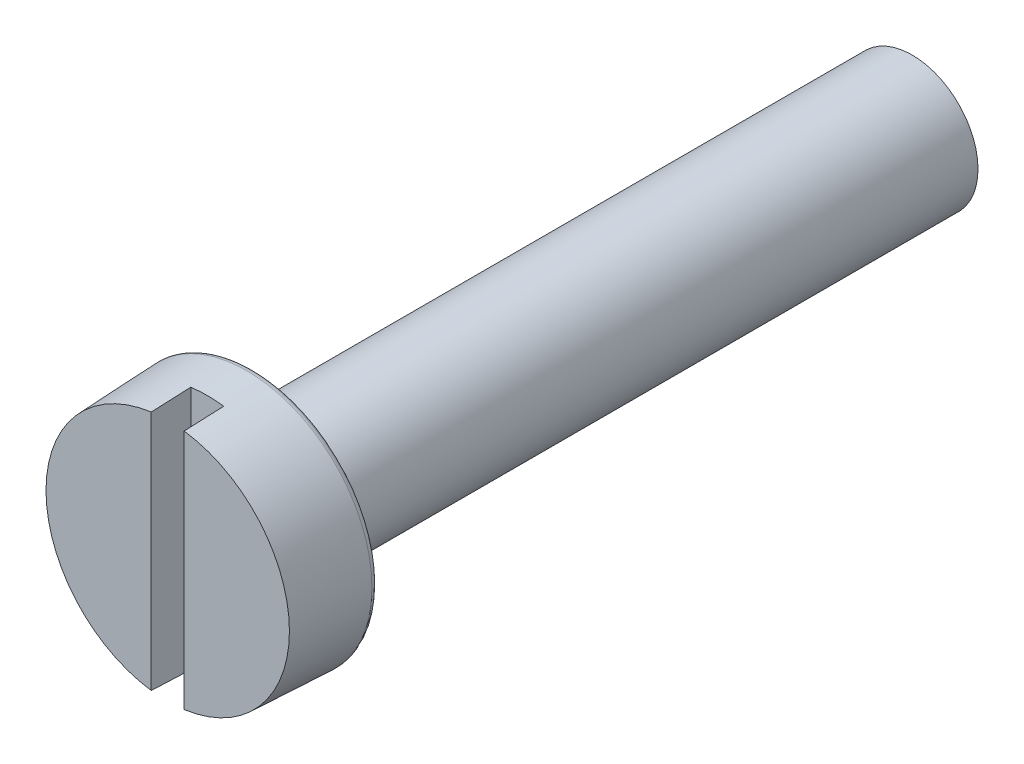
ISO-10303-21;
HEADER;
FILE_DESCRIPTION(('STEP AP214'),'2;1');
FILE_NAME('part.step','',(''),(''),'','','');
FILE_SCHEMA(('AUTOMOTIVE_DESIGN { 1 0 10303 214 1 1 1 1 }'));
ENDSEC;
DATA;
#1=APPLICATION_CONTEXT('core data for automotive mechanical design processes');
#2=APPLICATION_PROTOCOL_DEFINITION('international standard','automotive_design',2000,#1);
#3=PRODUCT_CONTEXT('',#1,'mechanical');
#4=PRODUCT('Part','Part','',(#3));
#5=PRODUCT_RELATED_PRODUCT_CATEGORY('part','',(#4));
#6=PRODUCT_DEFINITION_FORMATION('','',#4);
#7=PRODUCT_DEFINITION_CONTEXT('part definition',#1,'design');
#8=PRODUCT_DEFINITION('design','',#6,#7);
#9=PRODUCT_DEFINITION_SHAPE('','',#8);
#10=(LENGTH_UNIT() NAMED_UNIT(*) SI_UNIT(.MILLI.,.METRE.));
#11=(NAMED_UNIT(*) PLANE_ANGLE_UNIT() SI_UNIT($,.RADIAN.));
#12=(NAMED_UNIT(*) SI_UNIT($,.STERADIAN.) SOLID_ANGLE_UNIT());
#13=UNCERTAINTY_MEASURE_WITH_UNIT(LENGTH_MEASURE(1.E-05),#10,'distance_accuracy_value','');
#14=(GEOMETRIC_REPRESENTATION_CONTEXT(3) GLOBAL_UNCERTAINTY_ASSIGNED_CONTEXT((#13)) GLOBAL_UNIT_ASSIGNED_CONTEXT((#10,
#11,#12)) REPRESENTATION_CONTEXT('',''));
#15=CARTESIAN_POINT('',(0.,0.,0.));
#16=DIRECTION('',(0.,0.,1.));
#17=DIRECTION('',(1.,0.,0.));
#18=AXIS2_PLACEMENT_3D('',#15,#16,#17);
#19=CARTESIAN_POINT('',(0.,0.,1.30000000000001));
#20=DIRECTION('',(0.,0.,1.));
#21=DIRECTION('',(1.,0.,0.));
#22=AXIS2_PLACEMENT_3D('',#19,#20,#21);
#23=PLANE('',#22);
#24=DIRECTION('',(0.,1.,0.));
#25=VECTOR('',#24,1.);
#26=CARTESIAN_POINT('',(0.249999999999972,0.,1.30000000000001));
#27=LINE('',#26,#25);
#28=CARTESIAN_POINT('',(0.249999999999972,-1.83061496240046,1.29999999999998));
#29=VERTEX_POINT('',#28);
#30=CARTESIAN_POINT('',(0.249999999999945,1.83061496240049,1.30000000000002));
#31=VERTEX_POINT('',#30);
#32=EDGE_CURVE('E45',#29,#31,#27,.T.);
#33=ORIENTED_EDGE('',*,*,#32,.F.);
#34=CARTESIAN_POINT('',(0.,0.,1.30000000000001));
#35=DIRECTION('',(0.,0.,1.));
#36=DIRECTION('',(1.,0.,0.));
#37=AXIS2_PLACEMENT_3D('',#34,#35,#36);
#38=CIRCLE('',#37,1.84760686850978);
#39=EDGE_CURVE('E127',#29,#31,#38,.T.);
#40=ORIENTED_EDGE('',*,*,#39,.T.);
#41=EDGE_LOOP('',(#33,#40));
#42=FACE_BOUND('',#41,.T.);
#43=ADVANCED_FACE('F16',(#42),#23,.T.);
#44=DIRECTION('',(0.,-1.,0.));
#45=VECTOR('',#44,1.);
#46=CARTESIAN_POINT('',(-0.250000000000028,0.,1.30000000000001));
#47=LINE('',#46,#45);
#48=CARTESIAN_POINT('',(-0.250000000000056,1.83061496240049,1.29999999999999));
#49=VERTEX_POINT('',#48);
#50=CARTESIAN_POINT('',(-0.250000000000028,-1.83061496240048,1.29999999999998));
#51=VERTEX_POINT('',#50);
#52=EDGE_CURVE('E76',#49,#51,#47,.T.);
#53=ORIENTED_EDGE('',*,*,#52,.F.);
#54=EDGE_CURVE('E82',#49,#51,#38,.T.);
#55=ORIENTED_EDGE('',*,*,#54,.T.);
#56=EDGE_LOOP('',(#53,#55));
#57=FACE_BOUND('',#56,.T.);
#58=ADVANCED_FACE('F18',(#57),#23,.T.);
#59=CARTESIAN_POINT('',(0.,0.,-10.));
#60=DIRECTION('',(0.,0.,1.));
#61=DIRECTION('',(1.,0.,0.));
#62=AXIS2_PLACEMENT_3D('',#59,#60,#61);
#63=PLANE('',#62);
#64=CARTESIAN_POINT('',(0.,0.,-10.));
#65=DIRECTION('',(0.,0.,1.));
#66=DIRECTION('',(1.,0.,0.));
#67=AXIS2_PLACEMENT_3D('',#64,#65,#66);
#68=CIRCLE('',#67,1.);
#69=CARTESIAN_POINT('',(0.999999999999972,0.,-10.));
#70=VERTEX_POINT('',#69);
#71=EDGE_CURVE('E106',#70,#70,#68,.T.);
#72=ORIENTED_EDGE('',*,*,#71,.F.);
#73=EDGE_LOOP('',(#72));
#74=FACE_BOUND('',#73,.T.);
#75=ADVANCED_FACE('F135',(#74),#63,.F.);
#76=CARTESIAN_POINT('',(0.,0.,0.));
#77=DIRECTION('',(0.,0.,1.));
#78=DIRECTION('',(1.,0.,0.));
#79=AXIS2_PLACEMENT_3D('',#76,#77,#78);
#80=CYLINDRICAL_SURFACE('',#79,1.);
#81=CARTESIAN_POINT('',(0.,0.,-0.216500000000001));
#82=DIRECTION('',(0.,0.,1.));
#83=DIRECTION('',(1.,0.,0.));
#84=AXIS2_PLACEMENT_3D('',#81,#82,#83);
#85=CIRCLE('',#84,1.);
#86=CARTESIAN_POINT('',(1.,0.,-0.216500000000001));
#87=VERTEX_POINT('',#86);
#88=EDGE_CURVE('E109',#87,#87,#85,.T.);
#89=ORIENTED_EDGE('',*,*,#88,.F.);
#90=EDGE_LOOP('',(#89));
#91=FACE_BOUND('',#90,.T.);
#92=ORIENTED_EDGE('',*,*,#71,.T.);
#93=EDGE_LOOP('',(#92));
#94=FACE_BOUND('',#93,.T.);
#95=ADVANCED_FACE('F141',(#91,#94),#80,.T.);
#96=CARTESIAN_POINT('',(0.,0.,-0.216500000000001));
#97=DIRECTION('',(0.,0.,1.));
#98=DIRECTION('',(1.,0.,0.));
#99=AXIS2_PLACEMENT_3D('',#96,#97,#98);
#100=TOROIDAL_SURFACE('',#99,1.1,0.1);
#101=ORIENTED_EDGE('',*,*,#88,.T.);
#102=EDGE_LOOP('',(#101));
#103=FACE_BOUND('',#102,.T.);
#104=CARTESIAN_POINT('',(0.,0.,-0.130090786489328));
#105=DIRECTION('',(0.,0.,1.));
#106=DIRECTION('',(1.,0.,0.));
#107=AXIS2_PLACEMENT_3D('',#104,#105,#106);
#108=CIRCLE('',#107,1.04966663313003);
#109=CARTESIAN_POINT('',(1.04966663313003,0.,-0.130090786489328));
#110=VERTEX_POINT('',#109);
#111=EDGE_CURVE('E112',#110,#110,#108,.T.);
#112=ORIENTED_EDGE('',*,*,#111,.F.);
#113=EDGE_LOOP('',(#112));
#114=FACE_BOUND('',#113,.T.);
#115=ADVANCED_FACE('F174',(#103,#114),#100,.F.);
#116=CARTESIAN_POINT('',(0.,0.,-0.130090786489328));
#117=DIRECTION('',(0.,0.,1.));
#118=DIRECTION('',(1.,0.,0.));
#119=AXIS2_PLACEMENT_3D('',#116,#117,#118);
#120=CONICAL_SURFACE('',#119,1.04966663313003,1.04334386553758);
#121=CARTESIAN_POINT('',(0.,0.,-0.0135907864893259));
#122=DIRECTION('',(0.,0.,1.));
#123=DIRECTION('',(1.,0.,0.));
#124=AXIS2_PLACEMENT_3D('',#121,#122,#123);
#125=CIRCLE('',#124,1.24966663313003);
#126=CARTESIAN_POINT('',(1.24966663313003,0.,-0.0135907864893258));
#127=VERTEX_POINT('',#126);
#128=EDGE_CURVE('E115',#127,#127,#125,.T.);
#129=ORIENTED_EDGE('',*,*,#128,.F.);
#130=EDGE_LOOP('',(#129));
#131=FACE_BOUND('',#130,.T.);
#132=ORIENTED_EDGE('',*,*,#111,.T.);
#133=EDGE_LOOP('',(#132));
#134=FACE_BOUND('',#133,.T.);
#135=ADVANCED_FACE('F170',(#131,#134),#120,.T.);
#136=CARTESIAN_POINT('',(0.,0.,-0.0999999999999994));
#137=DIRECTION('',(0.,0.,1.));
#138=DIRECTION('',(1.,0.,0.));
#139=AXIS2_PLACEMENT_3D('',#136,#137,#138);
#140=TOROIDAL_SURFACE('',#139,1.3,0.1);
#141=ORIENTED_EDGE('',*,*,#128,.T.);
#142=EDGE_LOOP('',(#141));
#143=FACE_BOUND('',#142,.T.);
#144=CARTESIAN_POINT('',(0.,0.,0.));
#145=DIRECTION('',(0.,0.,1.));
#146=DIRECTION('',(1.,0.,0.));
#147=AXIS2_PLACEMENT_3D('',#144,#145,#146);
#148=CIRCLE('',#147,1.3);
#149=CARTESIAN_POINT('',(1.3,0.,0.));
#150=VERTEX_POINT('',#149);
#151=EDGE_CURVE('E118',#150,#150,#148,.T.);
#152=ORIENTED_EDGE('',*,*,#151,.F.);
#153=EDGE_LOOP('',(#152));
#154=FACE_BOUND('',#153,.T.);
#155=ADVANCED_FACE('F162',(#143,#154),#140,.F.);
#156=CARTESIAN_POINT('',(0.,1.3,0.));
#157=DIRECTION('',(0.,0.,1.));
#158=DIRECTION('',(1.,0.,0.));
#159=AXIS2_PLACEMENT_3D('',#156,#157,#158);
#160=PLANE('',#159);
#161=CARTESIAN_POINT('',(0.,0.,0.));
#162=DIRECTION('',(0.,0.,1.));
#163=DIRECTION('',(1.,0.,0.));
#164=AXIS2_PLACEMENT_3D('',#161,#162,#163);
#165=CIRCLE('',#164,1.8);
#166=CARTESIAN_POINT('',(1.8,0.,0.));
#167=VERTEX_POINT('',#166);
#168=EDGE_CURVE('E121',#167,#167,#165,.T.);
#169=ORIENTED_EDGE('',*,*,#168,.F.);
#170=EDGE_LOOP('',(#169));
#171=FACE_BOUND('',#170,.T.);
#172=ORIENTED_EDGE('',*,*,#151,.T.);
#173=EDGE_LOOP('',(#172));
#174=FACE_BOUND('',#173,.T.);
#175=ADVANCED_FACE('F157',(#171,#174),#160,.F.);
#176=CARTESIAN_POINT('',(0.,0.,0.0999999999999994));
#177=DIRECTION('',(0.,0.,1.));
#178=DIRECTION('',(1.,0.,0.));
#179=AXIS2_PLACEMENT_3D('',#176,#177,#178);
#180=TOROIDAL_SURFACE('',#179,1.8,0.1);
#181=CARTESIAN_POINT('',(0.,0.,0.0999999999999994));
#182=DIRECTION('',(0.,0.,1.));
#183=DIRECTION('',(1.,0.,0.));
#184=AXIS2_PLACEMENT_3D('',#181,#182,#183);
#185=CIRCLE('',#184,1.9);
#186=CARTESIAN_POINT('',(1.9,0.,0.0999999999999995));
#187=VERTEX_POINT('',#186);
#188=EDGE_CURVE('E124',#187,#187,#185,.T.);
#189=ORIENTED_EDGE('',*,*,#188,.F.);
#190=EDGE_LOOP('',(#189));
#191=FACE_BOUND('',#190,.T.);
#192=ORIENTED_EDGE('',*,*,#168,.T.);
#193=EDGE_LOOP('',(#192));
#194=FACE_BOUND('',#193,.T.);
#195=ADVANCED_FACE('F151',(#191,#194),#180,.T.);
#196=CARTESIAN_POINT('',(0.,0.,0.0999999999999994));
#197=DIRECTION('',(0.,0.,-1.));
#198=DIRECTION('',(-1.,0.,0.));
#199=AXIS2_PLACEMENT_3D('',#196,#197,#198);
#200=CONICAL_SURFACE('',#199,1.9,0.043633231299858);
#201=CARTESIAN_POINT('',(0.,0.,0.699999999999999));
#202=DIRECTION('',(0.,0.,-1.));
#203=DIRECTION('',(-1.,0.,0.));
#204=AXIS2_PLACEMENT_3D('',#201,#202,#203);
#205=CIRCLE('',#204,1.8738034342549);
#206=CARTESIAN_POINT('',(-0.250000000000028,1.85705124060308,0.70000000000001));
#207=VERTEX_POINT('',#206);
#208=CARTESIAN_POINT('',(0.249999999999972,1.85705124060309,0.699999999999999));
#209=VERTEX_POINT('',#208);
#210=EDGE_CURVE('E61',#207,#209,#205,.T.);
#211=ORIENTED_EDGE('',*,*,#210,.T.);
#212=CARTESIAN_POINT('',(0.25,1.99980126702874,-2.54234419161202));
#213=CARTESIAN_POINT('',(0.249999999999968,1.94758052302457,-1.35538596079296));
#214=CARTESIAN_POINT('',(0.249999999999949,1.89531934301762,-0.168429511733849));
#215=CARTESIAN_POINT('',(0.24999999999994,1.79071611098784,2.20547982309902));
#216=CARTESIAN_POINT('',(0.249999999999949,1.73837405896499,3.39243270887278));
#217=CARTESIAN_POINT('',(0.249999999999972,1.68599157093934,4.57938381288658));
#218=B_SPLINE_CURVE_WITH_KNOTS('',3,(#212,#213,#214,#215,#216,#217),.UNSPECIFIED.,.F.,.F.,(4,2,
4),(0.,3.56431923178727,7.12863846427887),.UNSPECIFIED.);
#219=EDGE_CURVE('E11',#209,#31,#218,.T.);
#220=ORIENTED_EDGE('',*,*,#219,.T.);
#221=ORIENTED_EDGE('',*,*,#39,.F.);
#222=CARTESIAN_POINT('',(0.249999999999972,-1.68599157093933,4.57938381288654));
#223=CARTESIAN_POINT('',(0.249999999999972,-1.73837405896496,3.39243270887275));
#224=CARTESIAN_POINT('',(0.249999999999972,-1.7907161109878,2.20547982309901));
#225=CARTESIAN_POINT('',(0.249999999999972,-1.89531934301758,-0.168429511733852));
#226=CARTESIAN_POINT('',(0.249999999999972,-1.94758052302452,-1.35538596079297));
#227=CARTESIAN_POINT('',(0.249999999999972,-1.9998012670287,-2.54234419161204));
#228=B_SPLINE_CURVE_WITH_KNOTS('',3,(#222,#223,#224,#225,#226,#227),.UNSPECIFIED.,.F.,.F.,(4,2,
4),(0.,3.56431923249155,7.12863846427884),.UNSPECIFIED.);
#229=CARTESIAN_POINT('',(0.25,-1.85705124060308,0.699999999999985));
#230=VERTEX_POINT('',#229);
#231=EDGE_CURVE('E67',#29,#230,#228,.T.);
#232=ORIENTED_EDGE('',*,*,#231,.T.);
#233=CARTESIAN_POINT('',(-0.25,-1.85705124060308,0.700000000000003));
#234=VERTEX_POINT('',#233);
#235=EDGE_CURVE('E69',#230,#234,#205,.T.);
#236=ORIENTED_EDGE('',*,*,#235,.T.);
#237=CARTESIAN_POINT('',(-0.250000000000028,-1.9998012670287,-2.54234419161202));
#238=CARTESIAN_POINT('',(-0.250000000000028,-1.94758052302452,-1.35538596079296));
#239=CARTESIAN_POINT('',(-0.250000000000028,-1.89531934301758,-0.168429511733846));
#240=CARTESIAN_POINT('',(-0.250000000000028,-1.7907161109878,2.20547982309901));
#241=CARTESIAN_POINT('',(-0.250000000000028,-1.73837405896496,3.39243270887275));
#242=CARTESIAN_POINT('',(-0.250000000000028,-1.68599157093933,4.57938381288654));
#243=B_SPLINE_CURVE_WITH_KNOTS('',3,(#237,#238,#239,#240,#241,#242),.UNSPECIFIED.,.F.,.F.,(4,2,
4),(0.,3.56431923178727,7.12863846427882),.UNSPECIFIED.);
#244=EDGE_CURVE('E74',#234,#51,#243,.T.);
#245=ORIENTED_EDGE('',*,*,#244,.T.);
#246=ORIENTED_EDGE('',*,*,#54,.F.);
#247=CARTESIAN_POINT('',(-0.250000000000028,1.68599157093933,4.57938381288658));
#248=CARTESIAN_POINT('',(-0.250000000000051,1.73837405896497,3.39243270887278));
#249=CARTESIAN_POINT('',(-0.25000000000006,1.79071611098783,2.20547982309902));
#250=CARTESIAN_POINT('',(-0.250000000000051,1.89531934301761,-0.168429511733845));
#251=CARTESIAN_POINT('',(-0.250000000000033,1.94758052302456,-1.35538596079295));
#252=CARTESIAN_POINT('',(-0.25,1.99980126702872,-2.54234419161201));
#253=B_SPLINE_CURVE_WITH_KNOTS('',3,(#247,#248,#249,#250,#251,#252),.UNSPECIFIED.,.F.,.F.,(4,2,
4),(0.,3.5643192324916,7.12863846427886),.UNSPECIFIED.);
#254=EDGE_CURVE('E30',#49,#207,#253,.T.);
#255=ORIENTED_EDGE('',*,*,#254,.T.);
#256=EDGE_LOOP('',(#211,#220,#221,#232,#236,#245,#246,#255));
#257=FACE_BOUND('',#256,.T.);
#258=ORIENTED_EDGE('',*,*,#188,.T.);
#259=EDGE_LOOP('',(#258));
#260=FACE_BOUND('',#259,.T.);
#261=ADVANCED_FACE('F79',(#257,#260),#200,.T.);
#262=CARTESIAN_POINT('',(0.249999999999972,0.,1.));
#263=DIRECTION('',(1.,0.,0.));
#264=DIRECTION('',(0.,0.,-1.));
#265=AXIS2_PLACEMENT_3D('',#262,#263,#264);
#266=PLANE('',#265);
#267=ORIENTED_EDGE('',*,*,#32,.T.);
#268=ORIENTED_EDGE('',*,*,#219,.F.);
#269=DIRECTION('',(0.,-1.,0.));
#270=VECTOR('',#269,1.);
#271=CARTESIAN_POINT('',(0.25,0.,0.699999999999999));
#272=LINE('',#271,#270);
#273=EDGE_CURVE('E64',#209,#230,#272,.T.);
#274=ORIENTED_EDGE('',*,*,#273,.T.);
#275=ORIENTED_EDGE('',*,*,#231,.F.);
#276=EDGE_LOOP('',(#267,#268,#274,#275));
#277=FACE_BOUND('',#276,.T.);
#278=ADVANCED_FACE('F99',(#277),#266,.F.);
#279=CARTESIAN_POINT('',(-0.250000000000028,0.,0.999999999999984));
#280=DIRECTION('',(-1.,0.,0.));
#281=DIRECTION('',(0.,0.,1.));
#282=AXIS2_PLACEMENT_3D('',#279,#280,#281);
#283=PLANE('',#282);
#284=DIRECTION('',(0.,1.,0.));
#285=VECTOR('',#284,1.);
#286=CARTESIAN_POINT('',(-0.25,0.,0.699999999999982));
#287=LINE('',#286,#285);
#288=EDGE_CURVE('E37',#234,#207,#287,.T.);
#289=ORIENTED_EDGE('',*,*,#288,.T.);
#290=ORIENTED_EDGE('',*,*,#254,.F.);
#291=ORIENTED_EDGE('',*,*,#52,.T.);
#292=ORIENTED_EDGE('',*,*,#244,.F.);
#293=EDGE_LOOP('',(#289,#290,#291,#292));
#294=FACE_BOUND('',#293,.T.);
#295=ADVANCED_FACE('F71',(#294),#283,.F.);
#296=CARTESIAN_POINT('',(-0.25,0.,0.699999999999982));
#297=DIRECTION('',(0.,0.,-1.));
#298=DIRECTION('',(-1.,0.,0.));
#299=AXIS2_PLACEMENT_3D('',#296,#297,#298);
#300=PLANE('',#299);
#301=ORIENTED_EDGE('',*,*,#288,.F.);
#302=ORIENTED_EDGE('',*,*,#235,.F.);
#303=ORIENTED_EDGE('',*,*,#273,.F.);
#304=ORIENTED_EDGE('',*,*,#210,.F.);
#305=EDGE_LOOP('',(#301,#302,#303,#304));
#306=FACE_BOUND('',#305,.T.);
#307=ADVANCED_FACE('F62',(#306),#300,.F.);
#308=CLOSED_SHELL('',(#43,#58,#75,#95,#115,#135,#155,#175,#195,#261,#278,#295,#307));
#309=MANIFOLD_SOLID_BREP('B1',#308);
#310=ADVANCED_BREP_SHAPE_REPRESENTATION('',(#18,#309),#14);
#311=SHAPE_DEFINITION_REPRESENTATION(#9,#310);
ENDSEC;
END-ISO-10303-21;
